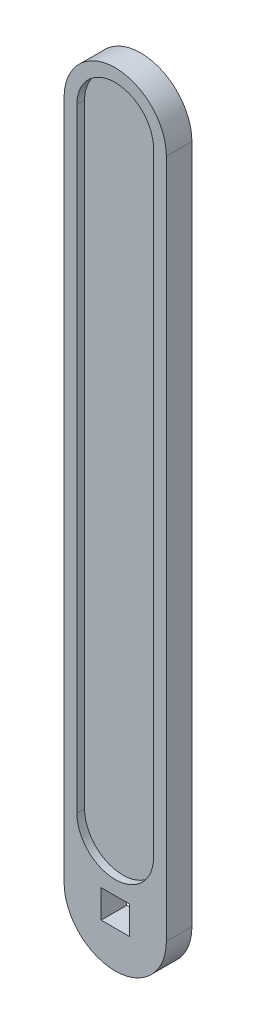
ISO-10303-21;
HEADER;
FILE_DESCRIPTION(('STEP AP214'),'2;1');
FILE_NAME('part.step','',(''),(''),'','','');
FILE_SCHEMA(('AUTOMOTIVE_DESIGN { 1 0 10303 214 1 1 1 1 }'));
ENDSEC;
DATA;
#1=APPLICATION_CONTEXT('core data for automotive mechanical design processes');
#2=APPLICATION_PROTOCOL_DEFINITION('international standard','automotive_design',2000,#1);
#3=PRODUCT_CONTEXT('',#1,'mechanical');
#4=PRODUCT('Part','Part','',(#3));
#5=PRODUCT_RELATED_PRODUCT_CATEGORY('part','',(#4));
#6=PRODUCT_DEFINITION_FORMATION('','',#4);
#7=PRODUCT_DEFINITION_CONTEXT('part definition',#1,'design');
#8=PRODUCT_DEFINITION('design','',#6,#7);
#9=PRODUCT_DEFINITION_SHAPE('','',#8);
#10=(LENGTH_UNIT() NAMED_UNIT(*) SI_UNIT(.MILLI.,.METRE.));
#11=(NAMED_UNIT(*) PLANE_ANGLE_UNIT() SI_UNIT($,.RADIAN.));
#12=(NAMED_UNIT(*) SI_UNIT($,.STERADIAN.) SOLID_ANGLE_UNIT());
#13=UNCERTAINTY_MEASURE_WITH_UNIT(LENGTH_MEASURE(1.E-05),#10,'distance_accuracy_value','');
#14=(GEOMETRIC_REPRESENTATION_CONTEXT(3) GLOBAL_UNCERTAINTY_ASSIGNED_CONTEXT((#13)) GLOBAL_UNIT_ASSIGNED_CONTEXT((#10,
#11,#12)) REPRESENTATION_CONTEXT('',''));
#15=CARTESIAN_POINT('',(0.,0.,0.));
#16=DIRECTION('',(0.,0.,1.));
#17=DIRECTION('',(1.,0.,0.));
#18=AXIS2_PLACEMENT_3D('',#15,#16,#17);
#19=CARTESIAN_POINT('',(0.,0.,1.));
#20=DIRECTION('',(0.,0.,1.));
#21=DIRECTION('',(1.,0.,0.));
#22=AXIS2_PLACEMENT_3D('',#19,#20,#21);
#23=PLANE('',#22);
#24=CARTESIAN_POINT('',(0.,0.,1.));
#25=DIRECTION('',(0.,0.,1.));
#26=DIRECTION('',(1.,0.,0.));
#27=AXIS2_PLACEMENT_3D('',#24,#25,#26);
#28=CIRCLE('',#27,7.5);
#29=CARTESIAN_POINT('',(-7.5,0.,1.));
#30=VERTEX_POINT('',#29);
#31=CARTESIAN_POINT('',(7.5,0.,1.));
#32=VERTEX_POINT('',#31);
#33=EDGE_CURVE('E75',#30,#32,#28,.T.);
#34=ORIENTED_EDGE('',*,*,#33,.T.);
#35=DIRECTION('',(0.,1.,0.));
#36=VECTOR('',#35,1.);
#37=CARTESIAN_POINT('',(7.5,0.,1.));
#38=LINE('',#37,#36);
#39=CARTESIAN_POINT('',(7.5,120.,1.));
#40=VERTEX_POINT('',#39);
#41=EDGE_CURVE('E174',#32,#40,#38,.T.);
#42=ORIENTED_EDGE('',*,*,#41,.T.);
#43=CARTESIAN_POINT('',(0.,120.,1.));
#44=DIRECTION('',(0.,0.,1.));
#45=DIRECTION('',(1.,0.,0.));
#46=AXIS2_PLACEMENT_3D('',#43,#44,#45);
#47=CIRCLE('',#46,7.5);
#48=CARTESIAN_POINT('',(-7.5,120.,1.));
#49=VERTEX_POINT('',#48);
#50=EDGE_CURVE('E43',#40,#49,#47,.T.);
#51=ORIENTED_EDGE('',*,*,#50,.T.);
#52=DIRECTION('',(0.,-1.,0.));
#53=VECTOR('',#52,1.);
#54=CARTESIAN_POINT('',(-7.5,0.,1.));
#55=LINE('',#54,#53);
#56=EDGE_CURVE('E11',#49,#30,#55,.T.);
#57=ORIENTED_EDGE('',*,*,#56,.T.);
#58=EDGE_LOOP('',(#34,#42,#51,#57));
#59=FACE_BOUND('',#58,.T.);
#60=ADVANCED_FACE('F33',(#59),#23,.T.);
#61=CARTESIAN_POINT('',(0.,120.,2.5));
#62=DIRECTION('',(0.,0.,-1.));
#63=DIRECTION('',(-1.,0.,0.));
#64=AXIS2_PLACEMENT_3D('',#61,#62,#63);
#65=CYLINDRICAL_SURFACE('',#64,7.5);
#66=CARTESIAN_POINT('',(0.,120.,-1.));
#67=DIRECTION('',(0.,0.,1.));
#68=DIRECTION('',(1.,0.,0.));
#69=AXIS2_PLACEMENT_3D('',#66,#67,#68);
#70=CIRCLE('',#69,7.5);
#71=CARTESIAN_POINT('',(7.5,120.,-1.));
#72=VERTEX_POINT('',#71);
#73=CARTESIAN_POINT('',(-7.5,120.,-1.));
#74=VERTEX_POINT('',#73);
#75=EDGE_CURVE('E67',#72,#74,#70,.T.);
#76=ORIENTED_EDGE('',*,*,#75,.T.);
#77=DIRECTION('',(0.,0.,-1.));
#78=VECTOR('',#77,1.);
#79=CARTESIAN_POINT('',(-7.5,120.,2.5));
#80=LINE('',#79,#78);
#81=CARTESIAN_POINT('',(-7.5,120.,-2.5));
#82=VERTEX_POINT('',#81);
#83=EDGE_CURVE('E82',#74,#82,#80,.T.);
#84=ORIENTED_EDGE('',*,*,#83,.T.);
#85=CARTESIAN_POINT('',(0.,120.,-2.5));
#86=DIRECTION('',(0.,0.,1.));
#87=DIRECTION('',(1.,0.,0.));
#88=AXIS2_PLACEMENT_3D('',#85,#86,#87);
#89=CIRCLE('',#88,7.5);
#90=CARTESIAN_POINT('',(7.5,120.,-2.5));
#91=VERTEX_POINT('',#90);
#92=EDGE_CURVE('E211',#91,#82,#89,.T.);
#93=ORIENTED_EDGE('',*,*,#92,.F.);
#94=DIRECTION('',(0.,0.,-1.));
#95=VECTOR('',#94,1.);
#96=CARTESIAN_POINT('',(7.5,120.,2.5));
#97=LINE('',#96,#95);
#98=EDGE_CURVE('E85',#72,#91,#97,.T.);
#99=ORIENTED_EDGE('',*,*,#98,.F.);
#100=EDGE_LOOP('',(#76,#84,#93,#99));
#101=FACE_BOUND('',#100,.T.);
#102=ADVANCED_FACE('F79',(#101),#65,.F.);
#103=CARTESIAN_POINT('',(-7.5,120.,2.5));
#104=DIRECTION('',(1.,0.,0.));
#105=DIRECTION('',(0.,0.,-1.));
#106=AXIS2_PLACEMENT_3D('',#103,#104,#105);
#107=PLANE('',#106);
#108=DIRECTION('',(0.,-1.,0.));
#109=VECTOR('',#108,1.);
#110=CARTESIAN_POINT('',(-7.5,0.,-1.));
#111=LINE('',#110,#109);
#112=CARTESIAN_POINT('',(-7.5,0.,-1.));
#113=VERTEX_POINT('',#112);
#114=EDGE_CURVE('E37',#74,#113,#111,.T.);
#115=ORIENTED_EDGE('',*,*,#114,.T.);
#116=DIRECTION('',(0.,0.,-1.));
#117=VECTOR('',#116,1.);
#118=CARTESIAN_POINT('',(-7.5,0.,2.5));
#119=LINE('',#118,#117);
#120=CARTESIAN_POINT('',(-7.5,0.,-2.5));
#121=VERTEX_POINT('',#120);
#122=EDGE_CURVE('E97',#113,#121,#119,.T.);
#123=ORIENTED_EDGE('',*,*,#122,.T.);
#124=DIRECTION('',(0.,-1.,0.));
#125=VECTOR('',#124,1.);
#126=CARTESIAN_POINT('',(-7.5,120.,-2.5));
#127=LINE('',#126,#125);
#128=EDGE_CURVE('E89',#82,#121,#127,.T.);
#129=ORIENTED_EDGE('',*,*,#128,.F.);
#130=ORIENTED_EDGE('',*,*,#83,.F.);
#131=EDGE_LOOP('',(#115,#123,#129,#130));
#132=FACE_BOUND('',#131,.T.);
#133=ADVANCED_FACE('F87',(#132),#107,.T.);
#134=CARTESIAN_POINT('',(0.,0.,2.5));
#135=DIRECTION('',(0.,0.,-1.));
#136=DIRECTION('',(-1.,0.,0.));
#137=AXIS2_PLACEMENT_3D('',#134,#135,#136);
#138=CYLINDRICAL_SURFACE('',#137,7.5);
#139=CARTESIAN_POINT('',(0.,0.,-1.));
#140=DIRECTION('',(0.,0.,1.));
#141=DIRECTION('',(1.,0.,0.));
#142=AXIS2_PLACEMENT_3D('',#139,#140,#141);
#143=CIRCLE('',#142,7.5);
#144=CARTESIAN_POINT('',(7.5,0.,-1.));
#145=VERTEX_POINT('',#144);
#146=EDGE_CURVE('E70',#113,#145,#143,.T.);
#147=ORIENTED_EDGE('',*,*,#146,.T.);
#148=DIRECTION('',(0.,0.,-1.));
#149=VECTOR('',#148,1.);
#150=CARTESIAN_POINT('',(7.5,0.,2.5));
#151=LINE('',#150,#149);
#152=CARTESIAN_POINT('',(7.5,0.,-2.5));
#153=VERTEX_POINT('',#152);
#154=EDGE_CURVE('E186',#145,#153,#151,.T.);
#155=ORIENTED_EDGE('',*,*,#154,.T.);
#156=CARTESIAN_POINT('',(0.,0.,-2.5));
#157=DIRECTION('',(0.,0.,1.));
#158=DIRECTION('',(1.,0.,0.));
#159=AXIS2_PLACEMENT_3D('',#156,#157,#158);
#160=CIRCLE('',#159,7.5);
#161=EDGE_CURVE('E196',#121,#153,#160,.T.);
#162=ORIENTED_EDGE('',*,*,#161,.F.);
#163=ORIENTED_EDGE('',*,*,#122,.F.);
#164=EDGE_LOOP('',(#147,#155,#162,#163));
#165=FACE_BOUND('',#164,.T.);
#166=ADVANCED_FACE('F191',(#165),#138,.F.);
#167=CARTESIAN_POINT('',(7.5,0.,2.5));
#168=DIRECTION('',(-1.,0.,0.));
#169=DIRECTION('',(0.,0.,1.));
#170=AXIS2_PLACEMENT_3D('',#167,#168,#169);
#171=PLANE('',#170);
#172=DIRECTION('',(0.,1.,0.));
#173=VECTOR('',#172,1.);
#174=CARTESIAN_POINT('',(7.5,0.,-1.));
#175=LINE('',#174,#173);
#176=EDGE_CURVE('E86',#145,#72,#175,.T.);
#177=ORIENTED_EDGE('',*,*,#176,.T.);
#178=ORIENTED_EDGE('',*,*,#98,.T.);
#179=DIRECTION('',(0.,1.,0.));
#180=VECTOR('',#179,1.);
#181=CARTESIAN_POINT('',(7.5,0.,-2.5));
#182=LINE('',#181,#180);
#183=EDGE_CURVE('E205',#153,#91,#182,.T.);
#184=ORIENTED_EDGE('',*,*,#183,.F.);
#185=ORIENTED_EDGE('',*,*,#154,.F.);
#186=EDGE_LOOP('',(#177,#178,#184,#185));
#187=FACE_BOUND('',#186,.T.);
#188=ADVANCED_FACE('F182',(#187),#171,.T.);
#189=CARTESIAN_POINT('',(0.,-13.,2.5));
#190=DIRECTION('',(0.,0.,1.));
#191=DIRECTION('',(1.,0.,0.));
#192=AXIS2_PLACEMENT_3D('',#189,#190,#191);
#193=PLANE('',#192);
#194=DIRECTION('',(1.,0.,0.));
#195=VECTOR('',#194,1.);
#196=CARTESIAN_POINT('',(2.75000000000001,-15.75,2.5));
#197=LINE('',#196,#195);
#198=CARTESIAN_POINT('',(-2.74999999999999,-15.75,2.5));
#199=VERTEX_POINT('',#198);
#200=CARTESIAN_POINT('',(2.75000000000001,-15.75,2.5));
#201=VERTEX_POINT('',#200);
#202=EDGE_CURVE('E104',#199,#201,#197,.T.);
#203=ORIENTED_EDGE('',*,*,#202,.F.);
#204=DIRECTION('',(0.,-1.,0.));
#205=VECTOR('',#204,1.);
#206=CARTESIAN_POINT('',(-2.74999999999999,-15.75,2.5));
#207=LINE('',#206,#205);
#208=CARTESIAN_POINT('',(-2.74999999999999,-10.25,2.5));
#209=VERTEX_POINT('',#208);
#210=EDGE_CURVE('E101',#209,#199,#207,.T.);
#211=ORIENTED_EDGE('',*,*,#210,.F.);
#212=DIRECTION('',(-1.,0.,0.));
#213=VECTOR('',#212,1.);
#214=CARTESIAN_POINT('',(2.75000000000001,-10.25,2.5));
#215=LINE('',#214,#213);
#216=CARTESIAN_POINT('',(2.75000000000001,-10.25,2.5));
#217=VERTEX_POINT('',#216);
#218=EDGE_CURVE('E111',#217,#209,#215,.T.);
#219=ORIENTED_EDGE('',*,*,#218,.F.);
#220=DIRECTION('',(0.,1.,0.));
#221=VECTOR('',#220,1.);
#222=CARTESIAN_POINT('',(2.75000000000001,-15.75,2.5));
#223=LINE('',#222,#221);
#224=EDGE_CURVE('E108',#201,#217,#223,.T.);
#225=ORIENTED_EDGE('',*,*,#224,.F.);
#226=EDGE_LOOP('',(#203,#211,#219,#225));
#227=FACE_BOUND('',#226,.T.);
#228=CARTESIAN_POINT('',(0.,-13.,2.5));
#229=DIRECTION('',(0.,0.,1.));
#230=DIRECTION('',(1.,0.,0.));
#231=AXIS2_PLACEMENT_3D('',#228,#229,#230);
#232=CIRCLE('',#231,9.99999999999999);
#233=CARTESIAN_POINT('',(-9.99999999999998,-13.,2.5));
#234=VERTEX_POINT('',#233);
#235=CARTESIAN_POINT('',(10.,-13.,2.5));
#236=VERTEX_POINT('',#235);
#237=EDGE_CURVE('E137',#234,#236,#232,.T.);
#238=ORIENTED_EDGE('',*,*,#237,.T.);
#239=DIRECTION('',(0.,1.,0.));
#240=VECTOR('',#239,1.);
#241=CARTESIAN_POINT('',(10.,-13.,2.5));
#242=LINE('',#241,#240);
#243=CARTESIAN_POINT('',(10.,120.,2.5));
#244=VERTEX_POINT('',#243);
#245=EDGE_CURVE('E140',#236,#244,#242,.T.);
#246=ORIENTED_EDGE('',*,*,#245,.T.);
#247=CARTESIAN_POINT('',(0.,120.,2.5));
#248=DIRECTION('',(0.,0.,1.));
#249=DIRECTION('',(1.,0.,0.));
#250=AXIS2_PLACEMENT_3D('',#247,#248,#249);
#251=CIRCLE('',#250,10.);
#252=CARTESIAN_POINT('',(-10.,120.,2.5));
#253=VERTEX_POINT('',#252);
#254=EDGE_CURVE('E144',#244,#253,#251,.T.);
#255=ORIENTED_EDGE('',*,*,#254,.T.);
#256=DIRECTION('',(0.,-1.,0.));
#257=VECTOR('',#256,1.);
#258=CARTESIAN_POINT('',(-10.,120.,2.5));
#259=LINE('',#258,#257);
#260=EDGE_CURVE('E147',#253,#234,#259,.T.);
#261=ORIENTED_EDGE('',*,*,#260,.T.);
#262=EDGE_LOOP('',(#238,#246,#255,#261));
#263=FACE_BOUND('',#262,.T.);
#264=DIRECTION('',(0.,-1.,0.));
#265=VECTOR('',#264,1.);
#266=CARTESIAN_POINT('',(-7.5,120.,2.5));
#267=LINE('',#266,#265);
#268=CARTESIAN_POINT('',(-7.5,120.,2.5));
#269=VERTEX_POINT('',#268);
#270=CARTESIAN_POINT('',(-7.5,0.,2.5));
#271=VERTEX_POINT('',#270);
#272=EDGE_CURVE('E217',#269,#271,#267,.T.);
#273=ORIENTED_EDGE('',*,*,#272,.F.);
#274=CARTESIAN_POINT('',(0.,120.,2.5));
#275=DIRECTION('',(0.,0.,1.));
#276=DIRECTION('',(1.,0.,0.));
#277=AXIS2_PLACEMENT_3D('',#274,#275,#276);
#278=CIRCLE('',#277,7.5);
#279=CARTESIAN_POINT('',(7.5,120.,2.5));
#280=VERTEX_POINT('',#279);
#281=EDGE_CURVE('E208',#280,#269,#278,.T.);
#282=ORIENTED_EDGE('',*,*,#281,.F.);
#283=DIRECTION('',(0.,1.,0.));
#284=VECTOR('',#283,1.);
#285=CARTESIAN_POINT('',(7.5,0.,2.5));
#286=LINE('',#285,#284);
#287=CARTESIAN_POINT('',(7.5,0.,2.5));
#288=VERTEX_POINT('',#287);
#289=EDGE_CURVE('E213',#288,#280,#286,.T.);
#290=ORIENTED_EDGE('',*,*,#289,.F.);
#291=CARTESIAN_POINT('',(0.,0.,2.5));
#292=DIRECTION('',(0.,0.,1.));
#293=DIRECTION('',(1.,0.,0.));
#294=AXIS2_PLACEMENT_3D('',#291,#292,#293);
#295=CIRCLE('',#294,7.5);
#296=EDGE_CURVE('E215',#271,#288,#295,.T.);
#297=ORIENTED_EDGE('',*,*,#296,.F.);
#298=EDGE_LOOP('',(#273,#282,#290,#297));
#299=FACE_BOUND('',#298,.T.);
#300=ADVANCED_FACE('F237',(#227,#263,#299),#193,.T.);
#301=CARTESIAN_POINT('',(0.,-13.,-2.5));
#302=DIRECTION('',(0.,0.,1.));
#303=DIRECTION('',(1.,0.,0.));
#304=AXIS2_PLACEMENT_3D('',#301,#302,#303);
#305=PLANE('',#304);
#306=DIRECTION('',(0.,-1.,0.));
#307=VECTOR('',#306,1.);
#308=CARTESIAN_POINT('',(-2.74999999999999,-15.75,-2.5));
#309=LINE('',#308,#307);
#310=CARTESIAN_POINT('',(-2.74999999999999,-10.25,-2.5));
#311=VERTEX_POINT('',#310);
#312=CARTESIAN_POINT('',(-2.74999999999999,-15.75,-2.5));
#313=VERTEX_POINT('',#312);
#314=EDGE_CURVE('E95',#311,#313,#309,.T.);
#315=ORIENTED_EDGE('',*,*,#314,.T.);
#316=DIRECTION('',(1.,0.,0.));
#317=VECTOR('',#316,1.);
#318=CARTESIAN_POINT('',(2.75000000000001,-15.75,-2.5));
#319=LINE('',#318,#317);
#320=CARTESIAN_POINT('',(2.75000000000001,-15.75,-2.5));
#321=VERTEX_POINT('',#320);
#322=EDGE_CURVE('E117',#313,#321,#319,.T.);
#323=ORIENTED_EDGE('',*,*,#322,.T.);
#324=DIRECTION('',(0.,1.,0.));
#325=VECTOR('',#324,1.);
#326=CARTESIAN_POINT('',(2.75000000000001,-15.75,-2.5));
#327=LINE('',#326,#325);
#328=CARTESIAN_POINT('',(2.75000000000001,-10.25,-2.5));
#329=VERTEX_POINT('',#328);
#330=EDGE_CURVE('E120',#321,#329,#327,.T.);
#331=ORIENTED_EDGE('',*,*,#330,.T.);
#332=DIRECTION('',(-1.,0.,0.));
#333=VECTOR('',#332,1.);
#334=CARTESIAN_POINT('',(2.75000000000001,-10.25,-2.5));
#335=LINE('',#334,#333);
#336=EDGE_CURVE('E105',#329,#311,#335,.T.);
#337=ORIENTED_EDGE('',*,*,#336,.T.);
#338=EDGE_LOOP('',(#315,#323,#331,#337));
#339=FACE_BOUND('',#338,.T.);
#340=CARTESIAN_POINT('',(0.,-13.,-2.5));
#341=DIRECTION('',(0.,0.,1.));
#342=DIRECTION('',(1.,0.,0.));
#343=AXIS2_PLACEMENT_3D('',#340,#341,#342);
#344=CIRCLE('',#343,9.99999999999999);
#345=CARTESIAN_POINT('',(-9.99999999999998,-13.,-2.5));
#346=VERTEX_POINT('',#345);
#347=CARTESIAN_POINT('',(10.,-13.,-2.5));
#348=VERTEX_POINT('',#347);
#349=EDGE_CURVE('E136',#346,#348,#344,.T.);
#350=ORIENTED_EDGE('',*,*,#349,.F.);
#351=DIRECTION('',(0.,-1.,0.));
#352=VECTOR('',#351,1.);
#353=CARTESIAN_POINT('',(-10.,0.,-2.5));
#354=LINE('',#353,#352);
#355=CARTESIAN_POINT('',(-10.,120.,-2.5));
#356=VERTEX_POINT('',#355);
#357=EDGE_CURVE('E141',#356,#346,#354,.T.);
#358=ORIENTED_EDGE('',*,*,#357,.F.);
#359=CARTESIAN_POINT('',(0.,120.,-2.5));
#360=DIRECTION('',(0.,0.,1.));
#361=DIRECTION('',(1.,0.,0.));
#362=AXIS2_PLACEMENT_3D('',#359,#360,#361);
#363=CIRCLE('',#362,10.);
#364=CARTESIAN_POINT('',(10.,120.,-2.5));
#365=VERTEX_POINT('',#364);
#366=EDGE_CURVE('E156',#365,#356,#363,.T.);
#367=ORIENTED_EDGE('',*,*,#366,.F.);
#368=DIRECTION('',(0.,1.,0.));
#369=VECTOR('',#368,1.);
#370=CARTESIAN_POINT('',(10.,0.,-2.5));
#371=LINE('',#370,#369);
#372=EDGE_CURVE('E153',#348,#365,#371,.T.);
#373=ORIENTED_EDGE('',*,*,#372,.F.);
#374=EDGE_LOOP('',(#350,#358,#367,#373));
#375=FACE_BOUND('',#374,.T.);
#376=ORIENTED_EDGE('',*,*,#92,.T.);
#377=ORIENTED_EDGE('',*,*,#128,.T.);
#378=ORIENTED_EDGE('',*,*,#161,.T.);
#379=ORIENTED_EDGE('',*,*,#183,.T.);
#380=EDGE_LOOP('',(#376,#377,#378,#379));
#381=FACE_BOUND('',#380,.T.);
#382=ADVANCED_FACE('F266',(#339,#375,#381),#305,.F.);
#383=CARTESIAN_POINT('',(0.,-13.,2.5));
#384=DIRECTION('',(0.,0.,-1.));
#385=DIRECTION('',(-1.,0.,0.));
#386=AXIS2_PLACEMENT_3D('',#383,#384,#385);
#387=CYLINDRICAL_SURFACE('',#386,9.99999999999999);
#388=ORIENTED_EDGE('',*,*,#349,.T.);
#389=DIRECTION('',(0.,0.,-1.));
#390=VECTOR('',#389,1.);
#391=CARTESIAN_POINT('',(10.,-13.,2.5));
#392=LINE('',#391,#390);
#393=EDGE_CURVE('E169',#236,#348,#392,.T.);
#394=ORIENTED_EDGE('',*,*,#393,.F.);
#395=ORIENTED_EDGE('',*,*,#237,.F.);
#396=DIRECTION('',(0.,0.,-1.));
#397=VECTOR('',#396,1.);
#398=CARTESIAN_POINT('',(-9.99999999999998,-13.,2.5));
#399=LINE('',#398,#397);
#400=EDGE_CURVE('E150',#234,#346,#399,.T.);
#401=ORIENTED_EDGE('',*,*,#400,.T.);
#402=EDGE_LOOP('',(#388,#394,#395,#401));
#403=FACE_BOUND('',#402,.T.);
#404=ADVANCED_FACE('F262',(#403),#387,.T.);
#405=CARTESIAN_POINT('',(10.,0.,2.5));
#406=DIRECTION('',(-1.,0.,0.));
#407=DIRECTION('',(0.,0.,1.));
#408=AXIS2_PLACEMENT_3D('',#405,#406,#407);
#409=PLANE('',#408);
#410=ORIENTED_EDGE('',*,*,#372,.T.);
#411=DIRECTION('',(0.,0.,-1.));
#412=VECTOR('',#411,1.);
#413=CARTESIAN_POINT('',(10.,120.,2.5));
#414=LINE('',#413,#412);
#415=EDGE_CURVE('E166',#244,#365,#414,.T.);
#416=ORIENTED_EDGE('',*,*,#415,.F.);
#417=ORIENTED_EDGE('',*,*,#245,.F.);
#418=ORIENTED_EDGE('',*,*,#393,.T.);
#419=EDGE_LOOP('',(#410,#416,#417,#418));
#420=FACE_BOUND('',#419,.T.);
#421=ADVANCED_FACE('F265',(#420),#409,.F.);
#422=CARTESIAN_POINT('',(0.,120.,2.5));
#423=DIRECTION('',(0.,0.,-1.));
#424=DIRECTION('',(-1.,0.,0.));
#425=AXIS2_PLACEMENT_3D('',#422,#423,#424);
#426=CYLINDRICAL_SURFACE('',#425,10.);
#427=ORIENTED_EDGE('',*,*,#366,.T.);
#428=DIRECTION('',(0.,0.,-1.));
#429=VECTOR('',#428,1.);
#430=CARTESIAN_POINT('',(-10.,120.,2.5));
#431=LINE('',#430,#429);
#432=EDGE_CURVE('E163',#253,#356,#431,.T.);
#433=ORIENTED_EDGE('',*,*,#432,.F.);
#434=ORIENTED_EDGE('',*,*,#254,.F.);
#435=ORIENTED_EDGE('',*,*,#415,.T.);
#436=EDGE_LOOP('',(#427,#433,#434,#435));
#437=FACE_BOUND('',#436,.T.);
#438=ADVANCED_FACE('F270',(#437),#426,.T.);
#439=CARTESIAN_POINT('',(-10.,0.,2.5));
#440=DIRECTION('',(1.,0.,0.));
#441=DIRECTION('',(0.,1.,0.));
#442=AXIS2_PLACEMENT_3D('',#439,#440,#441);
#443=PLANE('',#442);
#444=ORIENTED_EDGE('',*,*,#357,.T.);
#445=ORIENTED_EDGE('',*,*,#400,.F.);
#446=ORIENTED_EDGE('',*,*,#260,.F.);
#447=ORIENTED_EDGE('',*,*,#432,.T.);
#448=EDGE_LOOP('',(#444,#445,#446,#447));
#449=FACE_BOUND('',#448,.T.);
#450=ADVANCED_FACE('F274',(#449),#443,.F.);
#451=CARTESIAN_POINT('',(-2.74999999999999,-15.75,2.5));
#452=DIRECTION('',(1.,0.,0.));
#453=DIRECTION('',(0.,0.,-1.));
#454=AXIS2_PLACEMENT_3D('',#451,#452,#453);
#455=PLANE('',#454);
#456=ORIENTED_EDGE('',*,*,#314,.F.);
#457=DIRECTION('',(0.,0.,-1.));
#458=VECTOR('',#457,1.);
#459=CARTESIAN_POINT('',(-2.74999999999999,-10.25,2.5));
#460=LINE('',#459,#458);
#461=EDGE_CURVE('E114',#209,#311,#460,.T.);
#462=ORIENTED_EDGE('',*,*,#461,.F.);
#463=ORIENTED_EDGE('',*,*,#210,.T.);
#464=DIRECTION('',(0.,0.,-1.));
#465=VECTOR('',#464,1.);
#466=CARTESIAN_POINT('',(-2.74999999999999,-15.75,2.5));
#467=LINE('',#466,#465);
#468=EDGE_CURVE('E133',#199,#313,#467,.T.);
#469=ORIENTED_EDGE('',*,*,#468,.T.);
#470=EDGE_LOOP('',(#456,#462,#463,#469));
#471=FACE_BOUND('',#470,.T.);
#472=ADVANCED_FACE('F278',(#471),#455,.T.);
#473=CARTESIAN_POINT('',(2.75000000000001,-15.75,2.5));
#474=DIRECTION('',(0.,1.,0.));
#475=DIRECTION('',(0.,0.,1.));
#476=AXIS2_PLACEMENT_3D('',#473,#474,#475);
#477=PLANE('',#476);
#478=ORIENTED_EDGE('',*,*,#322,.F.);
#479=ORIENTED_EDGE('',*,*,#468,.F.);
#480=ORIENTED_EDGE('',*,*,#202,.T.);
#481=DIRECTION('',(0.,0.,-1.));
#482=VECTOR('',#481,1.);
#483=CARTESIAN_POINT('',(2.75000000000001,-15.75,2.5));
#484=LINE('',#483,#482);
#485=EDGE_CURVE('E130',#201,#321,#484,.T.);
#486=ORIENTED_EDGE('',*,*,#485,.T.);
#487=EDGE_LOOP('',(#478,#479,#480,#486));
#488=FACE_BOUND('',#487,.T.);
#489=ADVANCED_FACE('F288',(#488),#477,.T.);
#490=CARTESIAN_POINT('',(2.75000000000001,-15.75,2.5));
#491=DIRECTION('',(-1.,0.,0.));
#492=DIRECTION('',(0.,0.,1.));
#493=AXIS2_PLACEMENT_3D('',#490,#491,#492);
#494=PLANE('',#493);
#495=ORIENTED_EDGE('',*,*,#330,.F.);
#496=ORIENTED_EDGE('',*,*,#485,.F.);
#497=ORIENTED_EDGE('',*,*,#224,.T.);
#498=DIRECTION('',(0.,0.,-1.));
#499=VECTOR('',#498,1.);
#500=CARTESIAN_POINT('',(2.75000000000001,-10.25,2.5));
#501=LINE('',#500,#499);
#502=EDGE_CURVE('E127',#217,#329,#501,.T.);
#503=ORIENTED_EDGE('',*,*,#502,.T.);
#504=EDGE_LOOP('',(#495,#496,#497,#503));
#505=FACE_BOUND('',#504,.T.);
#506=ADVANCED_FACE('F292',(#505),#494,.T.);
#507=CARTESIAN_POINT('',(2.75000000000001,-10.25,2.5));
#508=DIRECTION('',(0.,-1.,0.));
#509=DIRECTION('',(1.,0.,0.));
#510=AXIS2_PLACEMENT_3D('',#507,#508,#509);
#511=PLANE('',#510);
#512=ORIENTED_EDGE('',*,*,#336,.F.);
#513=ORIENTED_EDGE('',*,*,#502,.F.);
#514=ORIENTED_EDGE('',*,*,#218,.T.);
#515=ORIENTED_EDGE('',*,*,#461,.T.);
#516=EDGE_LOOP('',(#512,#513,#514,#515));
#517=FACE_BOUND('',#516,.T.);
#518=ADVANCED_FACE('F296',(#517),#511,.T.);
#519=EDGE_CURVE('E91',#269,#49,#80,.T.);
#520=ORIENTED_EDGE('',*,*,#519,.T.);
#521=ORIENTED_EDGE('',*,*,#50,.F.);
#522=EDGE_CURVE('E51',#280,#40,#97,.T.);
#523=ORIENTED_EDGE('',*,*,#522,.F.);
#524=ORIENTED_EDGE('',*,*,#281,.T.);
#525=EDGE_LOOP('',(#520,#521,#523,#524));
#526=FACE_BOUND('',#525,.T.);
#527=ADVANCED_FACE('F225',(#526),#65,.F.);
#528=EDGE_CURVE('E92',#271,#30,#119,.T.);
#529=ORIENTED_EDGE('',*,*,#528,.T.);
#530=ORIENTED_EDGE('',*,*,#56,.F.);
#531=ORIENTED_EDGE('',*,*,#519,.F.);
#532=ORIENTED_EDGE('',*,*,#272,.T.);
#533=EDGE_LOOP('',(#529,#530,#531,#532));
#534=FACE_BOUND('',#533,.T.);
#535=ADVANCED_FACE('F234',(#534),#107,.T.);
#536=EDGE_CURVE('E197',#288,#32,#151,.T.);
#537=ORIENTED_EDGE('',*,*,#536,.T.);
#538=ORIENTED_EDGE('',*,*,#33,.F.);
#539=ORIENTED_EDGE('',*,*,#528,.F.);
#540=ORIENTED_EDGE('',*,*,#296,.T.);
#541=EDGE_LOOP('',(#537,#538,#539,#540));
#542=FACE_BOUND('',#541,.T.);
#543=ADVANCED_FACE('F240',(#542),#138,.F.);
#544=ORIENTED_EDGE('',*,*,#522,.T.);
#545=ORIENTED_EDGE('',*,*,#41,.F.);
#546=ORIENTED_EDGE('',*,*,#536,.F.);
#547=ORIENTED_EDGE('',*,*,#289,.T.);
#548=EDGE_LOOP('',(#544,#545,#546,#547));
#549=FACE_BOUND('',#548,.T.);
#550=ADVANCED_FACE('F247',(#549),#171,.T.);
#551=CARTESIAN_POINT('',(0.,0.,-1.));
#552=DIRECTION('',(0.,0.,1.));
#553=DIRECTION('',(1.,0.,0.));
#554=AXIS2_PLACEMENT_3D('',#551,#552,#553);
#555=PLANE('',#554);
#556=ORIENTED_EDGE('',*,*,#146,.F.);
#557=ORIENTED_EDGE('',*,*,#114,.F.);
#558=ORIENTED_EDGE('',*,*,#75,.F.);
#559=ORIENTED_EDGE('',*,*,#176,.F.);
#560=EDGE_LOOP('',(#556,#557,#558,#559));
#561=FACE_BOUND('',#560,.T.);
#562=ADVANCED_FACE('F35',(#561),#555,.F.);
#563=CLOSED_SHELL('',(#60,#102,#133,#166,#188,#300,#382,#404,#421,#438,#450,#472,#489,#506,#518,
#527,#535,#543,#550,#562));
#564=MANIFOLD_SOLID_BREP('B2',#563);
#565=ADVANCED_BREP_SHAPE_REPRESENTATION('',(#18,#564),#14);
#566=SHAPE_DEFINITION_REPRESENTATION(#9,#565);
ENDSEC;
END-ISO-10303-21;
